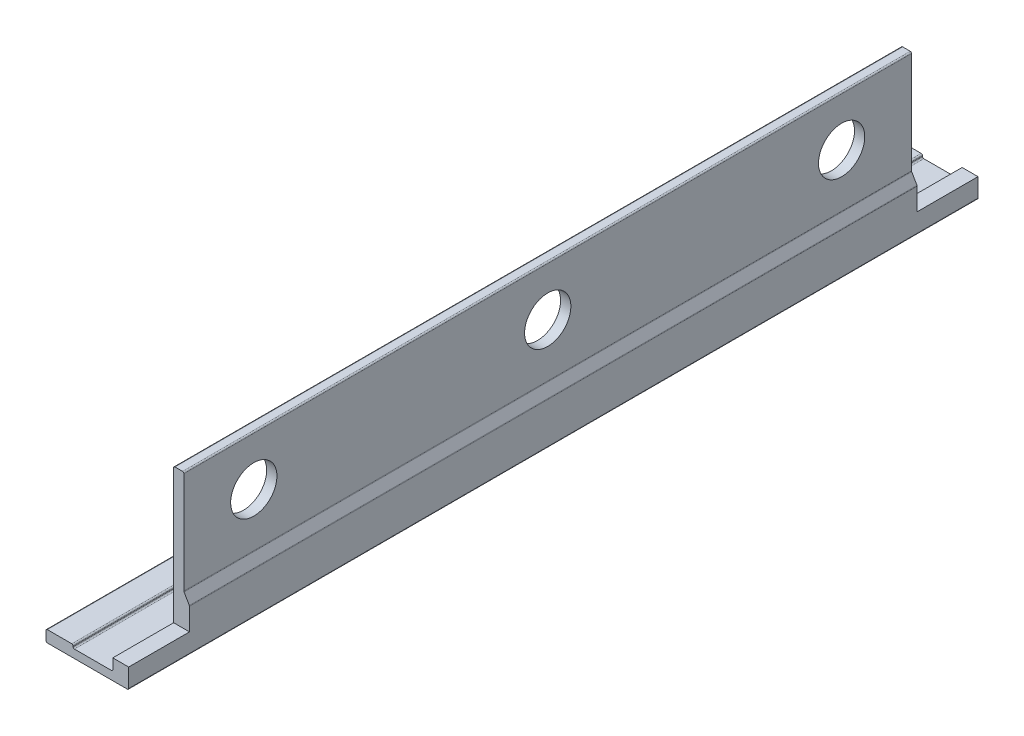
ISO-10303-21;
HEADER;
FILE_DESCRIPTION(('STEP AP214'),'2;1');
FILE_NAME('part.step','',(''),(''),'','','');
FILE_SCHEMA(('AUTOMOTIVE_DESIGN { 1 0 10303 214 1 1 1 1 }'));
ENDSEC;
DATA;
#1=APPLICATION_CONTEXT('core data for automotive mechanical design processes');
#2=APPLICATION_PROTOCOL_DEFINITION('international standard','automotive_design',2000,#1);
#3=PRODUCT_CONTEXT('',#1,'mechanical');
#4=PRODUCT('Part','Part','',(#3));
#5=PRODUCT_RELATED_PRODUCT_CATEGORY('part','',(#4));
#6=PRODUCT_DEFINITION_FORMATION('','',#4);
#7=PRODUCT_DEFINITION_CONTEXT('part definition',#1,'design');
#8=PRODUCT_DEFINITION('design','',#6,#7);
#9=PRODUCT_DEFINITION_SHAPE('','',#8);
#10=(LENGTH_UNIT() NAMED_UNIT(*) SI_UNIT(.MILLI.,.METRE.));
#11=(NAMED_UNIT(*) PLANE_ANGLE_UNIT() SI_UNIT($,.RADIAN.));
#12=(NAMED_UNIT(*) SI_UNIT($,.STERADIAN.) SOLID_ANGLE_UNIT());
#13=UNCERTAINTY_MEASURE_WITH_UNIT(LENGTH_MEASURE(1.E-05),#10,'distance_accuracy_value','');
#14=(GEOMETRIC_REPRESENTATION_CONTEXT(3) GLOBAL_UNCERTAINTY_ASSIGNED_CONTEXT((#13)) GLOBAL_UNIT_ASSIGNED_CONTEXT((#10,
#11,#12)) REPRESENTATION_CONTEXT('',''));
#15=CARTESIAN_POINT('',(0.,0.,0.));
#16=DIRECTION('',(0.,0.,1.));
#17=DIRECTION('',(1.,0.,0.));
#18=AXIS2_PLACEMENT_3D('',#15,#16,#17);
#19=CARTESIAN_POINT('',(-15.756534438729,-70.232902518071,0.));
#20=DIRECTION('',(-1.,0.,0.));
#21=DIRECTION('',(0.,1.,0.));
#22=AXIS2_PLACEMENT_3D('',#19,#20,#21);
#23=PLANE('',#22);
#24=DIRECTION('',(0.,-1.,0.));
#25=VECTOR('',#24,1.);
#26=CARTESIAN_POINT('',(-15.756534438729,-69.557902518071,-128.45));
#27=LINE('',#26,#25);
#28=CARTESIAN_POINT('',(-15.756534438729,-68.8829025180708,-128.45));
#29=VERTEX_POINT('',#28);
#30=CARTESIAN_POINT('',(-15.756534438729,-70.2329025180708,-128.45));
#31=VERTEX_POINT('',#30);
#32=EDGE_CURVE('E265',#29,#31,#27,.T.);
#33=ORIENTED_EDGE('',*,*,#32,.T.);
#34=DIRECTION('',(0.,0.,-1.));
#35=VECTOR('',#34,1.);
#36=CARTESIAN_POINT('',(-15.756534438729,-70.232902518071,-64.225));
#37=LINE('',#36,#35);
#38=CARTESIAN_POINT('',(-15.756534438729,-70.2329025180708,0.));
#39=VERTEX_POINT('',#38);
#40=EDGE_CURVE('E266',#39,#31,#37,.T.);
#41=ORIENTED_EDGE('',*,*,#40,.F.);
#42=DIRECTION('',(0.,1.,0.));
#43=VECTOR('',#42,1.);
#44=CARTESIAN_POINT('',(-15.756534438729,-69.557902518071,0.));
#45=LINE('',#44,#43);
#46=CARTESIAN_POINT('',(-15.756534438729,-68.8829025180708,0.));
#47=VERTEX_POINT('',#46);
#48=EDGE_CURVE('E271',#39,#47,#45,.T.);
#49=ORIENTED_EDGE('',*,*,#48,.T.);
#50=DIRECTION('',(0.,0.,1.));
#51=VECTOR('',#50,1.);
#52=CARTESIAN_POINT('',(-15.756534438729,-68.882902518071,-64.225));
#53=LINE('',#52,#51);
#54=EDGE_CURVE('E274',#29,#47,#53,.T.);
#55=ORIENTED_EDGE('',*,*,#54,.F.);
#56=EDGE_LOOP('',(#33,#41,#49,#55));
#57=FACE_BOUND('',#56,.T.);
#58=ADVANCED_FACE('F17',(#57),#23,.T.);
#59=CARTESIAN_POINT('',(-11.656534438729,-68.882902518071,0.));
#60=DIRECTION('',(1.,0.,0.));
#61=DIRECTION('',(0.,-1.,0.));
#62=AXIS2_PLACEMENT_3D('',#59,#60,#61);
#63=PLANE('',#62);
#64=DIRECTION('',(0.,1.,0.));
#65=VECTOR('',#64,1.);
#66=CARTESIAN_POINT('',(-11.656534438729,-68.932902518071,-128.45));
#67=LINE('',#66,#65);
#68=CARTESIAN_POINT('',(-11.656534438729,-68.9829025180708,-128.45));
#69=VERTEX_POINT('',#68);
#70=CARTESIAN_POINT('',(-11.656534438729,-68.8829025180708,-128.45));
#71=VERTEX_POINT('',#70);
#72=EDGE_CURVE('E170',#69,#71,#67,.T.);
#73=ORIENTED_EDGE('',*,*,#72,.T.);
#74=DIRECTION('',(0.,0.,-1.));
#75=VECTOR('',#74,1.);
#76=CARTESIAN_POINT('',(-11.656534438729,-68.882902518071,-64.225));
#77=LINE('',#76,#75);
#78=CARTESIAN_POINT('',(-11.656534438729,-68.8829025180708,0.));
#79=VERTEX_POINT('',#78);
#80=EDGE_CURVE('E169',#79,#71,#77,.T.);
#81=ORIENTED_EDGE('',*,*,#80,.F.);
#82=DIRECTION('',(0.,-1.,0.));
#83=VECTOR('',#82,1.);
#84=CARTESIAN_POINT('',(-11.656534438729,-68.932902518071,0.));
#85=LINE('',#84,#83);
#86=CARTESIAN_POINT('',(-11.656534438729,-68.9829025180708,0.));
#87=VERTEX_POINT('',#86);
#88=EDGE_CURVE('E165',#79,#87,#85,.T.);
#89=ORIENTED_EDGE('',*,*,#88,.T.);
#90=DIRECTION('',(0.,0.,1.));
#91=VECTOR('',#90,1.);
#92=CARTESIAN_POINT('',(-11.656534438729,-68.982902518071,-64.225));
#93=LINE('',#92,#91);
#94=EDGE_CURVE('E180',#69,#87,#93,.T.);
#95=ORIENTED_EDGE('',*,*,#94,.F.);
#96=EDGE_LOOP('',(#73,#81,#89,#95));
#97=FACE_BOUND('',#96,.T.);
#98=ADVANCED_FACE('F680',(#97),#63,.T.);
#99=CARTESIAN_POINT('',(-11.8565344387285,-68.8829025180706,0.));
#100=DIRECTION('',(0.,0.,-1.));
#101=DIRECTION('',(-1.,0.,0.));
#102=AXIS2_PLACEMENT_3D('',#99,#100,#101);
#103=CYLINDRICAL_SURFACE('',#102,0.199999999999594);
#104=CARTESIAN_POINT('',(-11.8565344387285,-68.8829025180706,-128.45));
#105=DIRECTION('',(0.,0.,-1.));
#106=DIRECTION('',(-1.,0.,0.));
#107=AXIS2_PLACEMENT_3D('',#104,#105,#106);
#108=CIRCLE('',#107,0.199999999999594);
#109=CARTESIAN_POINT('',(-11.8565344387288,-68.682902518071,-128.45));
#110=VERTEX_POINT('',#109);
#111=EDGE_CURVE('E175',#71,#110,#108,.F.);
#112=ORIENTED_EDGE('',*,*,#111,.T.);
#113=DIRECTION('',(0.,0.,-1.));
#114=VECTOR('',#113,1.);
#115=CARTESIAN_POINT('',(-11.856534438729,-68.682902518071,-64.225));
#116=LINE('',#115,#114);
#117=CARTESIAN_POINT('',(-11.8565344387288,-68.682902518071,0.));
#118=VERTEX_POINT('',#117);
#119=EDGE_CURVE('E172',#118,#110,#116,.T.);
#120=ORIENTED_EDGE('',*,*,#119,.F.);
#121=CARTESIAN_POINT('',(-11.8565344387285,-68.8829025180706,0.));
#122=DIRECTION('',(0.,0.,-1.));
#123=DIRECTION('',(-1.,0.,0.));
#124=AXIS2_PLACEMENT_3D('',#121,#122,#123);
#125=CIRCLE('',#124,0.199999999999594);
#126=EDGE_CURVE('E21',#118,#79,#125,.T.);
#127=ORIENTED_EDGE('',*,*,#126,.T.);
#128=ORIENTED_EDGE('',*,*,#80,.T.);
#129=EDGE_LOOP('',(#112,#120,#127,#128));
#130=FACE_BOUND('',#129,.T.);
#131=ADVANCED_FACE('F173',(#130),#103,.T.);
#132=CARTESIAN_POINT('',(-15.5565344387284,-68.8829025180707,0.));
#133=DIRECTION('',(0.,0.,-1.));
#134=DIRECTION('',(-1.,0.,0.));
#135=AXIS2_PLACEMENT_3D('',#132,#133,#134);
#136=CYLINDRICAL_SURFACE('',#135,0.20000000000013);
#137=CARTESIAN_POINT('',(-15.5565344387284,-68.8829025180707,-128.45));
#138=DIRECTION('',(0.,0.,-1.));
#139=DIRECTION('',(-1.,0.,0.));
#140=AXIS2_PLACEMENT_3D('',#137,#138,#139);
#141=CIRCLE('',#140,0.20000000000013);
#142=CARTESIAN_POINT('',(-15.5565344387287,-68.682902518071,-128.45));
#143=VERTEX_POINT('',#142);
#144=EDGE_CURVE('E277',#143,#29,#141,.F.);
#145=ORIENTED_EDGE('',*,*,#144,.T.);
#146=ORIENTED_EDGE('',*,*,#54,.T.);
#147=CARTESIAN_POINT('',(-15.5565344387284,-68.8829025180707,0.));
#148=DIRECTION('',(0.,0.,-1.));
#149=DIRECTION('',(-1.,0.,0.));
#150=AXIS2_PLACEMENT_3D('',#147,#148,#149);
#151=CIRCLE('',#150,0.20000000000013);
#152=CARTESIAN_POINT('',(-15.5565344387287,-68.682902518071,0.));
#153=VERTEX_POINT('',#152);
#154=EDGE_CURVE('E330',#47,#153,#151,.T.);
#155=ORIENTED_EDGE('',*,*,#154,.T.);
#156=DIRECTION('',(0.,0.,1.));
#157=VECTOR('',#156,1.);
#158=CARTESIAN_POINT('',(-15.556534438729,-68.682902518071,-64.225));
#159=LINE('',#158,#157);
#160=EDGE_CURVE('E179',#143,#153,#159,.T.);
#161=ORIENTED_EDGE('',*,*,#160,.F.);
#162=EDGE_LOOP('',(#145,#146,#155,#161));
#163=FACE_BOUND('',#162,.T.);
#164=ADVANCED_FACE('F332',(#163),#136,.T.);
#165=CARTESIAN_POINT('',(-15.5565344387292,-70.2329025180706,0.));
#166=DIRECTION('',(0.,0.,-1.));
#167=DIRECTION('',(-1.,0.,0.));
#168=AXIS2_PLACEMENT_3D('',#165,#166,#167);
#169=CYLINDRICAL_SURFACE('',#168,0.200000000000102);
#170=CARTESIAN_POINT('',(-15.5565344387292,-70.2329025180706,-128.45));
#171=DIRECTION('',(0.,0.,-1.));
#172=DIRECTION('',(-1.,0.,0.));
#173=AXIS2_PLACEMENT_3D('',#170,#171,#172);
#174=CIRCLE('',#173,0.200000000000102);
#175=CARTESIAN_POINT('',(-15.5565344387291,-70.432902518071,-128.45));
#176=VERTEX_POINT('',#175);
#177=EDGE_CURVE('E259',#31,#176,#174,.F.);
#178=ORIENTED_EDGE('',*,*,#177,.T.);
#179=DIRECTION('',(0.,0.,-1.));
#180=VECTOR('',#179,1.);
#181=CARTESIAN_POINT('',(-15.556534438729,-70.432902518071,-64.225));
#182=LINE('',#181,#180);
#183=CARTESIAN_POINT('',(-15.5565344387291,-70.432902518071,0.));
#184=VERTEX_POINT('',#183);
#185=EDGE_CURVE('E238',#184,#176,#182,.T.);
#186=ORIENTED_EDGE('',*,*,#185,.F.);
#187=CARTESIAN_POINT('',(-15.5565344387292,-70.2329025180706,0.));
#188=DIRECTION('',(0.,0.,-1.));
#189=DIRECTION('',(-1.,0.,0.));
#190=AXIS2_PLACEMENT_3D('',#187,#188,#189);
#191=CIRCLE('',#190,0.200000000000102);
#192=EDGE_CURVE('E269',#184,#39,#191,.T.);
#193=ORIENTED_EDGE('',*,*,#192,.T.);
#194=ORIENTED_EDGE('',*,*,#40,.T.);
#195=EDGE_LOOP('',(#178,#186,#193,#194));
#196=FACE_BOUND('',#195,.T.);
#197=ADVANCED_FACE('F339',(#196),#169,.T.);
#198=CARTESIAN_POINT('',(-4.0797395194856,-62.607069493158,0.));
#199=DIRECTION('',(0.866025403784433,0.500000000000009,0.));
#200=DIRECTION('',(0.500000000000009,-0.866025403784433,0.));
#201=AXIS2_PLACEMENT_3D('',#198,#199,#200);
#202=PLANE('',#201);
#203=DIRECTION('',(0.500000000000009,-0.866025403784434,0.));
#204=VECTOR('',#203,1.);
#205=CARTESIAN_POINT('',(-3.6815344387287,-63.296780924861,-9.2));
#206=LINE('',#205,#204);
#207=CARTESIAN_POINT('',(-4.07973951948535,-62.6070694931584,-9.2));
#208=VERTEX_POINT('',#207);
#209=CARTESIAN_POINT('',(-3.28332935797158,-63.9864923565644,-9.2));
#210=VERTEX_POINT('',#209);
#211=EDGE_CURVE('E254',#208,#210,#206,.T.);
#212=ORIENTED_EDGE('',*,*,#211,.T.);
#213=DIRECTION('',(0.,0.,1.));
#214=VECTOR('',#213,1.);
#215=CARTESIAN_POINT('',(-3.2833293579718,-63.986492356564,-64.225));
#216=LINE('',#215,#214);
#217=CARTESIAN_POINT('',(-3.28332935797158,-63.9864923565644,-119.25));
#218=VERTEX_POINT('',#217);
#219=EDGE_CURVE('E260',#218,#210,#216,.T.);
#220=ORIENTED_EDGE('',*,*,#219,.F.);
#221=DIRECTION('',(-0.500000000000009,0.866025403784434,0.));
#222=VECTOR('',#221,1.);
#223=CARTESIAN_POINT('',(-3.6815344387287,-63.296780924861,-119.25));
#224=LINE('',#223,#222);
#225=CARTESIAN_POINT('',(-4.07973951948535,-62.6070694931584,-119.25));
#226=VERTEX_POINT('',#225);
#227=EDGE_CURVE('E256',#218,#226,#224,.T.);
#228=ORIENTED_EDGE('',*,*,#227,.T.);
#229=DIRECTION('',(0.,0.,-1.));
#230=VECTOR('',#229,1.);
#231=CARTESIAN_POINT('',(-4.0797395194856,-62.607069493158,-64.225));
#232=LINE('',#231,#230);
#233=EDGE_CURVE('E250',#208,#226,#232,.T.);
#234=ORIENTED_EDGE('',*,*,#233,.F.);
#235=EDGE_LOOP('',(#212,#220,#228,#234));
#236=FACE_BOUND('',#235,.T.);
#237=ADVANCED_FACE('F479',(#236),#202,.T.);
#238=CARTESIAN_POINT('',(-11.4565344387282,-68.9829025180706,0.));
#239=DIRECTION('',(0.,0.,-1.));
#240=DIRECTION('',(-1.,0.,0.));
#241=AXIS2_PLACEMENT_3D('',#238,#239,#240);
#242=CYLINDRICAL_SURFACE('',#241,0.200000000000563);
#243=CARTESIAN_POINT('',(-11.4565344387282,-68.9829025180706,-128.45));
#244=DIRECTION('',(0.,0.,-1.));
#245=DIRECTION('',(-1.,0.,0.));
#246=AXIS2_PLACEMENT_3D('',#243,#244,#245);
#247=CIRCLE('',#246,0.200000000000563);
#248=CARTESIAN_POINT('',(-11.4565344387286,-69.182902518071,-128.45));
#249=VERTEX_POINT('',#248);
#250=EDGE_CURVE('E226',#69,#249,#247,.F.);
#251=ORIENTED_EDGE('',*,*,#250,.F.);
#252=ORIENTED_EDGE('',*,*,#94,.T.);
#253=CARTESIAN_POINT('',(-11.4565344387282,-68.9829025180706,0.));
#254=DIRECTION('',(0.,0.,-1.));
#255=DIRECTION('',(-1.,0.,0.));
#256=AXIS2_PLACEMENT_3D('',#253,#254,#255);
#257=CIRCLE('',#256,0.200000000000563);
#258=CARTESIAN_POINT('',(-11.4565344387286,-69.182902518071,0.));
#259=VERTEX_POINT('',#258);
#260=EDGE_CURVE('E249',#87,#259,#257,.F.);
#261=ORIENTED_EDGE('',*,*,#260,.T.);
#262=DIRECTION('',(0.,0.,1.));
#263=VECTOR('',#262,1.);
#264=CARTESIAN_POINT('',(-11.456534438729,-69.182902518071,-64.225));
#265=LINE('',#264,#263);
#266=EDGE_CURVE('E197',#249,#259,#265,.T.);
#267=ORIENTED_EDGE('',*,*,#266,.F.);
#268=EDGE_LOOP('',(#251,#252,#261,#267));
#269=FACE_BOUND('',#268,.T.);
#270=ADVANCED_FACE('F648',(#269),#242,.F.);
#271=CARTESIAN_POINT('',(-15.556534438729,-68.682902518071,0.));
#272=DIRECTION('',(0.,1.,0.));
#273=DIRECTION('',(1.,0.,0.));
#274=AXIS2_PLACEMENT_3D('',#271,#272,#273);
#275=PLANE('',#274);
#276=DIRECTION('',(1.,0.,0.));
#277=VECTOR('',#276,1.);
#278=CARTESIAN_POINT('',(-9.50653443872885,-68.682902518071,-128.45));
#279=LINE('',#278,#277);
#280=EDGE_CURVE('E224',#143,#110,#279,.T.);
#281=ORIENTED_EDGE('',*,*,#280,.F.);
#282=ORIENTED_EDGE('',*,*,#160,.T.);
#283=DIRECTION('',(-1.,0.,0.));
#284=VECTOR('',#283,1.);
#285=CARTESIAN_POINT('',(-9.50653443872885,-68.682902518071,0.));
#286=LINE('',#285,#284);
#287=EDGE_CURVE('E163',#118,#153,#286,.T.);
#288=ORIENTED_EDGE('',*,*,#287,.F.);
#289=ORIENTED_EDGE('',*,*,#119,.T.);
#290=EDGE_LOOP('',(#281,#282,#288,#289));
#291=FACE_BOUND('',#290,.T.);
#292=ADVANCED_FACE('F183',(#291),#275,.T.);
#293=CARTESIAN_POINT('',(-3.4565344387287,-70.432902518071,0.));
#294=DIRECTION('',(0.,-1.,0.));
#295=DIRECTION('',(-1.,0.,0.));
#296=AXIS2_PLACEMENT_3D('',#293,#294,#295);
#297=PLANE('',#296);
#298=DIRECTION('',(-1.,0.,0.));
#299=VECTOR('',#298,1.);
#300=CARTESIAN_POINT('',(-9.50653443872885,-70.432902518071,-128.45));
#301=LINE('',#300,#299);
#302=CARTESIAN_POINT('',(-3.45653443872915,-70.432902518071,-128.45));
#303=VERTEX_POINT('',#302);
#304=EDGE_CURVE('E227',#303,#176,#301,.T.);
#305=ORIENTED_EDGE('',*,*,#304,.F.);
#306=DIRECTION('',(0.,0.,-1.));
#307=VECTOR('',#306,1.);
#308=CARTESIAN_POINT('',(-3.4565344387287,-70.432902518071,-64.225));
#309=LINE('',#308,#307);
#310=CARTESIAN_POINT('',(-3.45653443872915,-70.432902518071,0.));
#311=VERTEX_POINT('',#310);
#312=EDGE_CURVE('E234',#311,#303,#309,.T.);
#313=ORIENTED_EDGE('',*,*,#312,.F.);
#314=DIRECTION('',(1.,0.,0.));
#315=VECTOR('',#314,1.);
#316=CARTESIAN_POINT('',(-9.50653443872885,-70.432902518071,0.));
#317=LINE('',#316,#315);
#318=EDGE_CURVE('E185',#184,#311,#317,.T.);
#319=ORIENTED_EDGE('',*,*,#318,.F.);
#320=ORIENTED_EDGE('',*,*,#185,.T.);
#321=EDGE_LOOP('',(#305,#313,#319,#320));
#322=FACE_BOUND('',#321,.T.);
#323=ADVANCED_FACE('F346',(#322),#297,.T.);
#324=CARTESIAN_POINT('',(-3.45653443872742,-64.0864923565643,0.));
#325=DIRECTION('',(0.,0.,-1.));
#326=DIRECTION('',(-1.,0.,0.));
#327=AXIS2_PLACEMENT_3D('',#324,#325,#326);
#328=CYLINDRICAL_SURFACE('',#327,0.19999999999888);
#329=CARTESIAN_POINT('',(-3.45653443872742,-64.0864923565643,-9.2));
#330=DIRECTION('',(0.,0.,-1.));
#331=DIRECTION('',(-1.,0.,0.));
#332=AXIS2_PLACEMENT_3D('',#329,#330,#331);
#333=CIRCLE('',#332,0.19999999999888);
#334=CARTESIAN_POINT('',(-3.256534438729,-64.0864923565641,-9.2));
#335=VERTEX_POINT('',#334);
#336=EDGE_CURVE('E237',#210,#335,#333,.T.);
#337=ORIENTED_EDGE('',*,*,#336,.T.);
#338=DIRECTION('',(0.,0.,1.));
#339=VECTOR('',#338,1.);
#340=CARTESIAN_POINT('',(-3.2565344387287,-64.086492356564,-64.225));
#341=LINE('',#340,#339);
#342=CARTESIAN_POINT('',(-3.2565344387287,-64.0864923565641,-119.25));
#343=VERTEX_POINT('',#342);
#344=EDGE_CURVE('E359',#343,#335,#341,.T.);
#345=ORIENTED_EDGE('',*,*,#344,.F.);
#346=CARTESIAN_POINT('',(-3.45653443872742,-64.0864923565643,-119.25));
#347=DIRECTION('',(0.,0.,-1.));
#348=DIRECTION('',(-1.,0.,0.));
#349=AXIS2_PLACEMENT_3D('',#346,#347,#348);
#350=CIRCLE('',#349,0.19999999999888);
#351=EDGE_CURVE('E240',#343,#218,#350,.F.);
#352=ORIENTED_EDGE('',*,*,#351,.T.);
#353=ORIENTED_EDGE('',*,*,#219,.T.);
#354=EDGE_LOOP('',(#337,#345,#352,#353));
#355=FACE_BOUND('',#354,.T.);
#356=ADVANCED_FACE('F484',(#355),#328,.T.);
#357=CARTESIAN_POINT('',(-3.4565344387296,-70.2329025180709,0.));
#358=DIRECTION('',(0.,0.,-1.));
#359=DIRECTION('',(-1.,0.,0.));
#360=AXIS2_PLACEMENT_3D('',#357,#358,#359);
#361=CYLINDRICAL_SURFACE('',#360,0.200000000000448);
#362=CARTESIAN_POINT('',(-3.4565344387296,-70.2329025180709,-128.45));
#363=DIRECTION('',(0.,0.,-1.));
#364=DIRECTION('',(-1.,0.,0.));
#365=AXIS2_PLACEMENT_3D('',#362,#363,#364);
#366=CIRCLE('',#365,0.200000000000448);
#367=CARTESIAN_POINT('',(-3.2565344387287,-70.232902518071,-128.45));
#368=VERTEX_POINT('',#367);
#369=EDGE_CURVE('E230',#368,#303,#366,.T.);
#370=ORIENTED_EDGE('',*,*,#369,.F.);
#371=DIRECTION('',(0.,0.,-1.));
#372=VECTOR('',#371,1.);
#373=CARTESIAN_POINT('',(-3.2565344387287,-70.232902518071,-64.225));
#374=LINE('',#373,#372);
#375=CARTESIAN_POINT('',(-3.2565344387287,-70.232902518071,0.));
#376=VERTEX_POINT('',#375);
#377=EDGE_CURVE('E214',#376,#368,#374,.T.);
#378=ORIENTED_EDGE('',*,*,#377,.F.);
#379=CARTESIAN_POINT('',(-3.4565344387296,-70.2329025180709,0.));
#380=DIRECTION('',(0.,0.,-1.));
#381=DIRECTION('',(-1.,0.,0.));
#382=AXIS2_PLACEMENT_3D('',#379,#380,#381);
#383=CIRCLE('',#382,0.200000000000448);
#384=EDGE_CURVE('E189',#311,#376,#383,.F.);
#385=ORIENTED_EDGE('',*,*,#384,.F.);
#386=ORIENTED_EDGE('',*,*,#312,.T.);
#387=EDGE_LOOP('',(#370,#378,#385,#386));
#388=FACE_BOUND('',#387,.T.);
#389=ADVANCED_FACE('F348',(#388),#361,.T.);
#390=CARTESIAN_POINT('',(-4.30653443872849,-47.132902518073,0.));
#391=DIRECTION('',(0.,0.,-1.));
#392=DIRECTION('',(-1.,0.,0.));
#393=AXIS2_PLACEMENT_3D('',#390,#391,#392);
#394=CYLINDRICAL_SURFACE('',#393,0.199999999999895);
#395=CARTESIAN_POINT('',(-4.30653443872849,-47.132902518073,-9.2));
#396=DIRECTION('',(0.,0.,-1.));
#397=DIRECTION('',(-1.,0.,0.));
#398=AXIS2_PLACEMENT_3D('',#395,#396,#397);
#399=CIRCLE('',#398,0.199999999999895);
#400=CARTESIAN_POINT('',(-4.30653443872865,-46.932902518073,-9.2));
#401=VERTEX_POINT('',#400);
#402=CARTESIAN_POINT('',(-4.1065344387287,-47.132902518073,-9.2));
#403=VERTEX_POINT('',#402);
#404=EDGE_CURVE('E317',#401,#403,#399,.T.);
#405=ORIENTED_EDGE('',*,*,#404,.T.);
#406=DIRECTION('',(0.,0.,1.));
#407=VECTOR('',#406,1.);
#408=CARTESIAN_POINT('',(-4.1065344387287,-47.132902518073,-64.225));
#409=LINE('',#408,#407);
#410=CARTESIAN_POINT('',(-4.106534438727,-47.132902518073,-119.25));
#411=VERTEX_POINT('',#410);
#412=EDGE_CURVE('E213',#411,#403,#409,.T.);
#413=ORIENTED_EDGE('',*,*,#412,.F.);
#414=CARTESIAN_POINT('',(-4.30653443872849,-47.132902518073,-119.25));
#415=DIRECTION('',(0.,0.,-1.));
#416=DIRECTION('',(-1.,0.,0.));
#417=AXIS2_PLACEMENT_3D('',#414,#415,#416);
#418=CIRCLE('',#417,0.199999999999895);
#419=CARTESIAN_POINT('',(-4.30653443872865,-46.932902518073,-119.25));
#420=VERTEX_POINT('',#419);
#421=EDGE_CURVE('E236',#411,#420,#418,.F.);
#422=ORIENTED_EDGE('',*,*,#421,.T.);
#423=DIRECTION('',(0.,0.,-1.));
#424=VECTOR('',#423,1.);
#425=CARTESIAN_POINT('',(-4.3065344387288,-46.932902518073,-64.225));
#426=LINE('',#425,#424);
#427=EDGE_CURVE('E362',#401,#420,#426,.T.);
#428=ORIENTED_EDGE('',*,*,#427,.F.);
#429=EDGE_LOOP('',(#405,#413,#422,#428));
#430=FACE_BOUND('',#429,.T.);
#431=ADVANCED_FACE('F466',(#430),#394,.T.);
#432=CARTESIAN_POINT('',(-3.90653443872707,-62.5070694931582,0.));
#433=DIRECTION('',(0.,0.,-1.));
#434=DIRECTION('',(-1.,0.,0.));
#435=AXIS2_PLACEMENT_3D('',#432,#433,#434);
#436=CYLINDRICAL_SURFACE('',#435,0.200000000001471);
#437=CARTESIAN_POINT('',(-3.90653443872707,-62.5070694931582,-9.2));
#438=DIRECTION('',(0.,0.,-1.));
#439=DIRECTION('',(-1.,0.,0.));
#440=AXIS2_PLACEMENT_3D('',#437,#438,#439);
#441=CIRCLE('',#440,0.200000000001471);
#442=CARTESIAN_POINT('',(-4.1065344387287,-62.5070694931581,-9.2));
#443=VERTEX_POINT('',#442);
#444=EDGE_CURVE('E253',#443,#208,#441,.F.);
#445=ORIENTED_EDGE('',*,*,#444,.T.);
#446=ORIENTED_EDGE('',*,*,#233,.T.);
#447=CARTESIAN_POINT('',(-3.90653443872707,-62.5070694931582,-119.25));
#448=DIRECTION('',(0.,0.,-1.));
#449=DIRECTION('',(-1.,0.,0.));
#450=AXIS2_PLACEMENT_3D('',#447,#448,#449);
#451=CIRCLE('',#450,0.200000000001471);
#452=CARTESIAN_POINT('',(-4.106534438727,-62.5070694931581,-119.25));
#453=VERTEX_POINT('',#452);
#454=EDGE_CURVE('E315',#226,#453,#451,.T.);
#455=ORIENTED_EDGE('',*,*,#454,.T.);
#456=DIRECTION('',(0.,0.,-1.));
#457=VECTOR('',#456,1.);
#458=CARTESIAN_POINT('',(-4.1065344387287,-62.507069493158,-64.225));
#459=LINE('',#458,#457);
#460=EDGE_CURVE('E376',#443,#453,#459,.T.);
#461=ORIENTED_EDGE('',*,*,#460,.F.);
#462=EDGE_LOOP('',(#445,#446,#455,#461));
#463=FACE_BOUND('',#462,.T.);
#464=ADVANCED_FACE('F480',(#463),#436,.F.);
#465=CARTESIAN_POINT('',(-16.381534438729,-45.757902518073,-128.45));
#466=DIRECTION('',(0.,0.,-1.));
#467=DIRECTION('',(1.,0.,0.));
#468=AXIS2_PLACEMENT_3D('',#465,#466,#467);
#469=PLANE('',#468);
#470=CARTESIAN_POINT('',(-5.85653443872866,-68.9829025180711,-128.45));
#471=DIRECTION('',(0.,0.,-1.));
#472=DIRECTION('',(-1.,0.,0.));
#473=AXIS2_PLACEMENT_3D('',#470,#471,#472);
#474=CIRCLE('',#473,0.199999999999947);
#475=CARTESIAN_POINT('',(-5.85653443872868,-69.182902518071,-128.45));
#476=VERTEX_POINT('',#475);
#477=CARTESIAN_POINT('',(-5.6565344387287,-68.982902518071,-128.45));
#478=VERTEX_POINT('',#477);
#479=EDGE_CURVE('E221',#476,#478,#474,.F.);
#480=ORIENTED_EDGE('',*,*,#479,.T.);
#481=DIRECTION('',(0.,1.,0.));
#482=VECTOR('',#481,1.);
#483=CARTESIAN_POINT('',(-5.6565344387287,-58.682902518072,-128.45));
#484=LINE('',#483,#482);
#485=CARTESIAN_POINT('',(-5.6565344387287,-67.432902518071,-128.45));
#486=VERTEX_POINT('',#485);
#487=EDGE_CURVE('E217',#478,#486,#484,.T.);
#488=ORIENTED_EDGE('',*,*,#487,.T.);
#489=DIRECTION('',(1.,0.,0.));
#490=VECTOR('',#489,1.);
#491=CARTESIAN_POINT('',(-4.3860075997521,-67.432902518071,-128.45));
#492=LINE('',#491,#490);
#493=CARTESIAN_POINT('',(-3.2565344387287,-67.432902518071,-128.45));
#494=VERTEX_POINT('',#493);
#495=EDGE_CURVE('E379',#486,#494,#492,.T.);
#496=ORIENTED_EDGE('',*,*,#495,.T.);
#497=DIRECTION('',(0.,1.,0.));
#498=VECTOR('',#497,1.);
#499=CARTESIAN_POINT('',(-3.2565344387287,-67.1596974373175,-128.45));
#500=LINE('',#499,#498);
#501=EDGE_CURVE('E210',#368,#494,#500,.T.);
#502=ORIENTED_EDGE('',*,*,#501,.F.);
#503=ORIENTED_EDGE('',*,*,#369,.T.);
#504=ORIENTED_EDGE('',*,*,#304,.T.);
#505=ORIENTED_EDGE('',*,*,#177,.F.);
#506=ORIENTED_EDGE('',*,*,#32,.F.);
#507=ORIENTED_EDGE('',*,*,#144,.F.);
#508=ORIENTED_EDGE('',*,*,#280,.T.);
#509=ORIENTED_EDGE('',*,*,#111,.F.);
#510=ORIENTED_EDGE('',*,*,#72,.F.);
#511=ORIENTED_EDGE('',*,*,#250,.T.);
#512=DIRECTION('',(-1.,0.,0.));
#513=VECTOR('',#512,1.);
#514=CARTESIAN_POINT('',(-8.65653443872885,-69.182902518071,-128.45));
#515=LINE('',#514,#513);
#516=EDGE_CURVE('E220',#476,#249,#515,.T.);
#517=ORIENTED_EDGE('',*,*,#516,.F.);
#518=EDGE_LOOP('',(#480,#488,#496,#502,#503,#504,#505,#506,#507,#508,#509,#510,#511,#517));
#519=FACE_BOUND('',#518,.T.);
#520=ADVANCED_FACE('F454',(#519),#469,.T.);
#521=CARTESIAN_POINT('',(-11.456534438729,-69.182902518071,0.));
#522=DIRECTION('',(0.,1.,0.));
#523=DIRECTION('',(1.,0.,0.));
#524=AXIS2_PLACEMENT_3D('',#521,#522,#523);
#525=PLANE('',#524);
#526=ORIENTED_EDGE('',*,*,#516,.T.);
#527=ORIENTED_EDGE('',*,*,#266,.T.);
#528=DIRECTION('',(-1.,0.,0.));
#529=VECTOR('',#528,1.);
#530=CARTESIAN_POINT('',(-9.50653443872885,-69.182902518071,0.));
#531=LINE('',#530,#529);
#532=CARTESIAN_POINT('',(-5.85653443872868,-69.182902518071,0.));
#533=VERTEX_POINT('',#532);
#534=EDGE_CURVE('E186',#533,#259,#531,.T.);
#535=ORIENTED_EDGE('',*,*,#534,.F.);
#536=DIRECTION('',(0.,0.,1.));
#537=VECTOR('',#536,1.);
#538=CARTESIAN_POINT('',(-5.8565344387287,-69.182902518071,-64.225));
#539=LINE('',#538,#537);
#540=EDGE_CURVE('E200',#476,#533,#539,.T.);
#541=ORIENTED_EDGE('',*,*,#540,.F.);
#542=EDGE_LOOP('',(#526,#527,#535,#541));
#543=FACE_BOUND('',#542,.T.);
#544=ADVANCED_FACE('F551',(#543),#525,.T.);
#545=CARTESIAN_POINT('',(-16.381534438729,-71.607902518071,0.));
#546=DIRECTION('',(0.,0.,1.));
#547=DIRECTION('',(1.,0.,0.));
#548=AXIS2_PLACEMENT_3D('',#545,#546,#547);
#549=PLANE('',#548);
#550=ORIENTED_EDGE('',*,*,#384,.T.);
#551=DIRECTION('',(0.,-1.,0.));
#552=VECTOR('',#551,1.);
#553=CARTESIAN_POINT('',(-3.2565344387287,-67.1596974373175,0.));
#554=LINE('',#553,#552);
#555=CARTESIAN_POINT('',(-3.2565344387287,-67.432902518071,0.));
#556=VERTEX_POINT('',#555);
#557=EDGE_CURVE('E233',#556,#376,#554,.T.);
#558=ORIENTED_EDGE('',*,*,#557,.F.);
#559=DIRECTION('',(-1.,0.,0.));
#560=VECTOR('',#559,1.);
#561=CARTESIAN_POINT('',(-4.3860075997521,-67.432902518071,0.));
#562=LINE('',#561,#560);
#563=CARTESIAN_POINT('',(-5.6565344387287,-67.432902518071,0.));
#564=VERTEX_POINT('',#563);
#565=EDGE_CURVE('E203',#556,#564,#562,.T.);
#566=ORIENTED_EDGE('',*,*,#565,.T.);
#567=DIRECTION('',(0.,-1.,0.));
#568=VECTOR('',#567,1.);
#569=CARTESIAN_POINT('',(-5.6565344387287,-58.682902518072,0.));
#570=LINE('',#569,#568);
#571=CARTESIAN_POINT('',(-5.6565344387287,-68.982902518071,0.));
#572=VERTEX_POINT('',#571);
#573=EDGE_CURVE('E192',#564,#572,#570,.T.);
#574=ORIENTED_EDGE('',*,*,#573,.T.);
#575=CARTESIAN_POINT('',(-5.85653443872866,-68.9829025180711,0.));
#576=DIRECTION('',(0.,0.,-1.));
#577=DIRECTION('',(-1.,0.,0.));
#578=AXIS2_PLACEMENT_3D('',#575,#576,#577);
#579=CIRCLE('',#578,0.199999999999947);
#580=EDGE_CURVE('E204',#533,#572,#579,.F.);
#581=ORIENTED_EDGE('',*,*,#580,.F.);
#582=ORIENTED_EDGE('',*,*,#534,.T.);
#583=ORIENTED_EDGE('',*,*,#260,.F.);
#584=ORIENTED_EDGE('',*,*,#88,.F.);
#585=ORIENTED_EDGE('',*,*,#126,.F.);
#586=ORIENTED_EDGE('',*,*,#287,.T.);
#587=ORIENTED_EDGE('',*,*,#154,.F.);
#588=ORIENTED_EDGE('',*,*,#48,.F.);
#589=ORIENTED_EDGE('',*,*,#192,.F.);
#590=ORIENTED_EDGE('',*,*,#318,.T.);
#591=EDGE_LOOP('',(#550,#558,#566,#574,#581,#582,#583,#584,#585,#586,#587,#588,#589,#590));
#592=FACE_BOUND('',#591,.T.);
#593=ADVANCED_FACE('F161',(#592),#549,.T.);
#594=CARTESIAN_POINT('',(-5.4565344387288,-46.932902518073,0.));
#595=DIRECTION('',(0.,1.,0.));
#596=DIRECTION('',(1.,0.,0.));
#597=AXIS2_PLACEMENT_3D('',#594,#595,#596);
#598=PLANE('',#597);
#599=DIRECTION('',(1.,0.,0.));
#600=VECTOR('',#599,1.);
#601=CARTESIAN_POINT('',(-4.3860075997521,-46.932902518073,-9.2));
#602=LINE('',#601,#600);
#603=CARTESIAN_POINT('',(-5.45653443872873,-46.932902518073,-9.2));
#604=VERTEX_POINT('',#603);
#605=EDGE_CURVE('E402',#604,#401,#602,.T.);
#606=ORIENTED_EDGE('',*,*,#605,.T.);
#607=ORIENTED_EDGE('',*,*,#427,.T.);
#608=DIRECTION('',(-1.,0.,0.));
#609=VECTOR('',#608,1.);
#610=CARTESIAN_POINT('',(-4.8815344387288,-46.932902518073,-119.25));
#611=LINE('',#610,#609);
#612=CARTESIAN_POINT('',(-5.45653443872873,-46.932902518073,-119.25));
#613=VERTEX_POINT('',#612);
#614=EDGE_CURVE('E307',#420,#613,#611,.T.);
#615=ORIENTED_EDGE('',*,*,#614,.T.);
#616=DIRECTION('',(0.,0.,-1.));
#617=VECTOR('',#616,1.);
#618=CARTESIAN_POINT('',(-5.4565344387288,-46.932902518073,-64.225));
#619=LINE('',#618,#617);
#620=EDGE_CURVE('E301',#604,#613,#619,.T.);
#621=ORIENTED_EDGE('',*,*,#620,.F.);
#622=EDGE_LOOP('',(#606,#607,#615,#621));
#623=FACE_BOUND('',#622,.T.);
#624=ADVANCED_FACE('F467',(#623),#598,.T.);
#625=CARTESIAN_POINT('',(-3.2565344387287,-64.086492356564,0.));
#626=DIRECTION('',(1.,0.,0.));
#627=DIRECTION('',(0.,-1.,0.));
#628=AXIS2_PLACEMENT_3D('',#625,#626,#627);
#629=PLANE('',#628);
#630=ORIENTED_EDGE('',*,*,#377,.T.);
#631=ORIENTED_EDGE('',*,*,#501,.T.);
#632=DIRECTION('',(0.,0.,1.));
#633=VECTOR('',#632,1.);
#634=CARTESIAN_POINT('',(-3.2565344387287,-67.432902518071,-129.25));
#635=LINE('',#634,#633);
#636=CARTESIAN_POINT('',(-3.2565344387287,-67.432902518071,-119.25));
#637=VERTEX_POINT('',#636);
#638=EDGE_CURVE('E305',#494,#637,#635,.T.);
#639=ORIENTED_EDGE('',*,*,#638,.T.);
#640=DIRECTION('',(0.,1.,0.));
#641=VECTOR('',#640,1.);
#642=CARTESIAN_POINT('',(-3.2565344387287,-53.432902518071,-119.25));
#643=LINE('',#642,#641);
#644=EDGE_CURVE('E294',#637,#343,#643,.T.);
#645=ORIENTED_EDGE('',*,*,#644,.T.);
#646=ORIENTED_EDGE('',*,*,#344,.T.);
#647=DIRECTION('',(0.,-1.,0.));
#648=VECTOR('',#647,1.);
#649=CARTESIAN_POINT('',(-3.2565344387293,-53.432902518071,-9.2));
#650=LINE('',#649,#648);
#651=CARTESIAN_POINT('',(-3.2565344387291,-67.432902518071,-9.2));
#652=VERTEX_POINT('',#651);
#653=EDGE_CURVE('E369',#335,#652,#650,.T.);
#654=ORIENTED_EDGE('',*,*,#653,.T.);
#655=DIRECTION('',(0.,0.,1.));
#656=VECTOR('',#655,1.);
#657=CARTESIAN_POINT('',(-3.2565344387287,-67.432902518071,0.8));
#658=LINE('',#657,#656);
#659=EDGE_CURVE('E356',#652,#556,#658,.T.);
#660=ORIENTED_EDGE('',*,*,#659,.T.);
#661=ORIENTED_EDGE('',*,*,#557,.T.);
#662=EDGE_LOOP('',(#630,#631,#639,#645,#646,#654,#660,#661));
#663=FACE_BOUND('',#662,.T.);
#664=ADVANCED_FACE('F353',(#663),#629,.T.);
#665=CARTESIAN_POINT('',(-4.1065344387287,-47.132902518073,0.));
#666=DIRECTION('',(1.,0.,0.));
#667=DIRECTION('',(0.,-1.,0.));
#668=AXIS2_PLACEMENT_3D('',#665,#666,#667);
#669=PLANE('',#668);
#670=CARTESIAN_POINT('',(-4.10653443872867,-54.482902518071,-108.675));
#671=DIRECTION('',(1.,0.,0.));
#672=DIRECTION('',(0.,1.,0.));
#673=AXIS2_PLACEMENT_3D('',#670,#671,#672);
#674=CIRCLE('',#673,3.49999999999978);
#675=CARTESIAN_POINT('',(-4.10653443872873,-50.9829025180712,-108.675));
#676=VERTEX_POINT('',#675);
#677=EDGE_CURVE('E291',#676,#676,#674,.F.);
#678=ORIENTED_EDGE('',*,*,#677,.T.);
#679=EDGE_LOOP('',(#678));
#680=FACE_BOUND('',#679,.T.);
#681=CARTESIAN_POINT('',(-4.10653443872867,-54.482902518071,-64.225));
#682=DIRECTION('',(1.,0.,0.));
#683=DIRECTION('',(0.,1.,0.));
#684=AXIS2_PLACEMENT_3D('',#681,#682,#683);
#685=CIRCLE('',#684,3.4999999999998);
#686=CARTESIAN_POINT('',(-4.10653443872873,-50.9829025180712,-64.225));
#687=VERTEX_POINT('',#686);
#688=EDGE_CURVE('E288',#687,#687,#685,.F.);
#689=ORIENTED_EDGE('',*,*,#688,.T.);
#690=EDGE_LOOP('',(#689));
#691=FACE_BOUND('',#690,.T.);
#692=CARTESIAN_POINT('',(-4.10653443872867,-54.482902518071,-19.775));
#693=DIRECTION('',(1.,0.,0.));
#694=DIRECTION('',(0.,1.,0.));
#695=AXIS2_PLACEMENT_3D('',#692,#693,#694);
#696=CIRCLE('',#695,3.4999999999998);
#697=CARTESIAN_POINT('',(-4.10653443872873,-50.9829025180712,-19.775));
#698=VERTEX_POINT('',#697);
#699=EDGE_CURVE('E285',#698,#698,#696,.F.);
#700=ORIENTED_EDGE('',*,*,#699,.T.);
#701=EDGE_LOOP('',(#700));
#702=FACE_BOUND('',#701,.T.);
#703=DIRECTION('',(0.,-1.,0.));
#704=VECTOR('',#703,1.);
#705=CARTESIAN_POINT('',(-4.1065344387287,-53.432902518071,-9.2));
#706=LINE('',#705,#704);
#707=EDGE_CURVE('E302',#403,#443,#706,.T.);
#708=ORIENTED_EDGE('',*,*,#707,.T.);
#709=ORIENTED_EDGE('',*,*,#460,.T.);
#710=DIRECTION('',(0.,1.,0.));
#711=VECTOR('',#710,1.);
#712=CARTESIAN_POINT('',(-4.1065344387253,-53.432902518071,-119.25));
#713=LINE('',#712,#711);
#714=EDGE_CURVE('E297',#453,#411,#713,.T.);
#715=ORIENTED_EDGE('',*,*,#714,.T.);
#716=ORIENTED_EDGE('',*,*,#412,.T.);
#717=EDGE_LOOP('',(#708,#709,#715,#716));
#718=FACE_BOUND('',#717,.T.);
#719=ADVANCED_FACE('F473',(#680,#691,#702,#718),#669,.T.);
#720=CARTESIAN_POINT('',(-5.6565344387287,-67.432902518071,-119.25));
#721=DIRECTION('',(0.,-1.,0.));
#722=DIRECTION('',(0.,0.,-1.));
#723=AXIS2_PLACEMENT_3D('',#720,#721,#722);
#724=PLANE('',#723);
#725=DIRECTION('',(1.,0.,0.));
#726=VECTOR('',#725,1.);
#727=CARTESIAN_POINT('',(-4.3860075997521,-67.432902518071,-119.25));
#728=LINE('',#727,#726);
#729=CARTESIAN_POINT('',(-5.6565344387287,-67.432902518071,-119.25));
#730=VERTEX_POINT('',#729);
#731=EDGE_CURVE('E296',#730,#637,#728,.T.);
#732=ORIENTED_EDGE('',*,*,#731,.T.);
#733=ORIENTED_EDGE('',*,*,#638,.F.);
#734=ORIENTED_EDGE('',*,*,#495,.F.);
#735=DIRECTION('',(0.,0.,-1.));
#736=VECTOR('',#735,1.);
#737=CARTESIAN_POINT('',(-5.6565344387287,-67.432902518071,-64.225));
#738=LINE('',#737,#736);
#739=EDGE_CURVE('E209',#730,#486,#738,.T.);
#740=ORIENTED_EDGE('',*,*,#739,.F.);
#741=EDGE_LOOP('',(#732,#733,#734,#740));
#742=FACE_BOUND('',#741,.T.);
#743=ADVANCED_FACE('F459',(#742),#724,.F.);
#744=CARTESIAN_POINT('',(-5.85653443872866,-68.9829025180711,0.));
#745=DIRECTION('',(0.,0.,-1.));
#746=DIRECTION('',(-1.,0.,0.));
#747=AXIS2_PLACEMENT_3D('',#744,#745,#746);
#748=CYLINDRICAL_SURFACE('',#747,0.199999999999947);
#749=ORIENTED_EDGE('',*,*,#479,.F.);
#750=ORIENTED_EDGE('',*,*,#540,.T.);
#751=ORIENTED_EDGE('',*,*,#580,.T.);
#752=DIRECTION('',(0.,0.,1.));
#753=VECTOR('',#752,1.);
#754=CARTESIAN_POINT('',(-5.6565344387287,-68.982902518071,-64.225));
#755=LINE('',#754,#753);
#756=EDGE_CURVE('E205',#478,#572,#755,.T.);
#757=ORIENTED_EDGE('',*,*,#756,.F.);
#758=EDGE_LOOP('',(#749,#750,#751,#757));
#759=FACE_BOUND('',#758,.T.);
#760=ADVANCED_FACE('F538',(#759),#748,.F.);
#761=CARTESIAN_POINT('',(-5.6565344387287,-67.432902518071,10.8));
#762=DIRECTION('',(0.,-1.,0.));
#763=DIRECTION('',(0.,0.,-1.));
#764=AXIS2_PLACEMENT_3D('',#761,#762,#763);
#765=PLANE('',#764);
#766=DIRECTION('',(-1.,0.,0.));
#767=VECTOR('',#766,1.);
#768=CARTESIAN_POINT('',(-4.3860075997521,-67.432902518071,-9.2));
#769=LINE('',#768,#767);
#770=CARTESIAN_POINT('',(-5.6565344387287,-67.432902518071,-9.2));
#771=VERTEX_POINT('',#770);
#772=EDGE_CURVE('E399',#652,#771,#769,.T.);
#773=ORIENTED_EDGE('',*,*,#772,.T.);
#774=DIRECTION('',(0.,0.,-1.));
#775=VECTOR('',#774,1.);
#776=CARTESIAN_POINT('',(-5.6565344387287,-67.432902518071,-64.225));
#777=LINE('',#776,#775);
#778=EDGE_CURVE('E208',#564,#771,#777,.T.);
#779=ORIENTED_EDGE('',*,*,#778,.F.);
#780=ORIENTED_EDGE('',*,*,#565,.F.);
#781=ORIENTED_EDGE('',*,*,#659,.F.);
#782=EDGE_LOOP('',(#773,#779,#780,#781));
#783=FACE_BOUND('',#782,.T.);
#784=ADVANCED_FACE('F535',(#783),#765,.F.);
#785=CARTESIAN_POINT('',(-5.6565344387287,-67.432902518071,-9.2));
#786=DIRECTION('',(0.,0.,-1.));
#787=DIRECTION('',(0.,1.,0.));
#788=AXIS2_PLACEMENT_3D('',#785,#786,#787);
#789=PLANE('',#788);
#790=ORIENTED_EDGE('',*,*,#444,.F.);
#791=ORIENTED_EDGE('',*,*,#707,.F.);
#792=ORIENTED_EDGE('',*,*,#404,.F.);
#793=ORIENTED_EDGE('',*,*,#605,.F.);
#794=CARTESIAN_POINT('',(-5.45653443872865,-47.1329025180729,-9.2));
#795=DIRECTION('',(0.,0.,-1.));
#796=DIRECTION('',(-1.,0.,0.));
#797=AXIS2_PLACEMENT_3D('',#794,#795,#796);
#798=CIRCLE('',#797,0.199999999999979);
#799=CARTESIAN_POINT('',(-5.6565344387287,-47.132902518073,-9.2));
#800=VERTEX_POINT('',#799);
#801=EDGE_CURVE('E298',#800,#604,#798,.T.);
#802=ORIENTED_EDGE('',*,*,#801,.F.);
#803=DIRECTION('',(0.,1.,0.));
#804=VECTOR('',#803,1.);
#805=CARTESIAN_POINT('',(-5.6565344387287,-58.057902518072,-9.2));
#806=LINE('',#805,#804);
#807=EDGE_CURVE('E396',#771,#800,#806,.T.);
#808=ORIENTED_EDGE('',*,*,#807,.F.);
#809=ORIENTED_EDGE('',*,*,#772,.F.);
#810=ORIENTED_EDGE('',*,*,#653,.F.);
#811=ORIENTED_EDGE('',*,*,#336,.F.);
#812=ORIENTED_EDGE('',*,*,#211,.F.);
#813=EDGE_LOOP('',(#790,#791,#792,#793,#802,#808,#809,#810,#811,#812));
#814=FACE_BOUND('',#813,.T.);
#815=ADVANCED_FACE('F469',(#814),#789,.F.);
#816=CARTESIAN_POINT('',(-5.45653443872865,-47.1329025180729,0.));
#817=DIRECTION('',(0.,0.,-1.));
#818=DIRECTION('',(-1.,0.,0.));
#819=AXIS2_PLACEMENT_3D('',#816,#817,#818);
#820=CYLINDRICAL_SURFACE('',#819,0.199999999999979);
#821=ORIENTED_EDGE('',*,*,#801,.T.);
#822=ORIENTED_EDGE('',*,*,#620,.T.);
#823=CARTESIAN_POINT('',(-5.45653443872865,-47.1329025180729,-119.25));
#824=DIRECTION('',(0.,0.,-1.));
#825=DIRECTION('',(-1.,0.,0.));
#826=AXIS2_PLACEMENT_3D('',#823,#824,#825);
#827=CIRCLE('',#826,0.199999999999979);
#828=CARTESIAN_POINT('',(-5.6565344387287,-47.132902518073,-119.25));
#829=VERTEX_POINT('',#828);
#830=EDGE_CURVE('E36',#613,#829,#827,.F.);
#831=ORIENTED_EDGE('',*,*,#830,.T.);
#832=DIRECTION('',(0.,0.,-1.));
#833=VECTOR('',#832,1.);
#834=CARTESIAN_POINT('',(-5.6565344387287,-47.132902518073,-64.225));
#835=LINE('',#834,#833);
#836=EDGE_CURVE('E414',#800,#829,#835,.T.);
#837=ORIENTED_EDGE('',*,*,#836,.F.);
#838=EDGE_LOOP('',(#821,#822,#831,#837));
#839=FACE_BOUND('',#838,.T.);
#840=ADVANCED_FACE('F530',(#839),#820,.T.);
#841=CARTESIAN_POINT('',(-5.6565344387287,-39.432902518071,-119.25));
#842=DIRECTION('',(0.,0.,1.));
#843=DIRECTION('',(0.,-1.,0.));
#844=AXIS2_PLACEMENT_3D('',#841,#842,#843);
#845=PLANE('',#844);
#846=ORIENTED_EDGE('',*,*,#731,.F.);
#847=DIRECTION('',(0.,-1.,0.));
#848=VECTOR('',#847,1.);
#849=CARTESIAN_POINT('',(-5.6565344387287,-58.057902518072,-119.25));
#850=LINE('',#849,#848);
#851=EDGE_CURVE('E284',#829,#730,#850,.T.);
#852=ORIENTED_EDGE('',*,*,#851,.F.);
#853=ORIENTED_EDGE('',*,*,#830,.F.);
#854=ORIENTED_EDGE('',*,*,#614,.F.);
#855=ORIENTED_EDGE('',*,*,#421,.F.);
#856=ORIENTED_EDGE('',*,*,#714,.F.);
#857=ORIENTED_EDGE('',*,*,#454,.F.);
#858=ORIENTED_EDGE('',*,*,#227,.F.);
#859=ORIENTED_EDGE('',*,*,#351,.F.);
#860=ORIENTED_EDGE('',*,*,#644,.F.);
#861=EDGE_LOOP('',(#846,#852,#853,#854,#855,#856,#857,#858,#859,#860));
#862=FACE_BOUND('',#861,.T.);
#863=ADVANCED_FACE('F441',(#862),#845,.F.);
#864=CARTESIAN_POINT('',(-5.65653443872867,-54.482902518071,-108.675));
#865=DIRECTION('',(1.,0.,0.));
#866=DIRECTION('',(0.,1.,0.));
#867=AXIS2_PLACEMENT_3D('',#864,#865,#866);
#868=CYLINDRICAL_SURFACE('',#867,3.49999999999978);
#869=CARTESIAN_POINT('',(-5.65653443872867,-54.482902518071,-108.675));
#870=DIRECTION('',(1.,0.,0.));
#871=DIRECTION('',(0.,1.,0.));
#872=AXIS2_PLACEMENT_3D('',#869,#870,#871);
#873=CIRCLE('',#872,3.49999999999978);
#874=CARTESIAN_POINT('',(-5.65653443872873,-50.9829025180712,-108.675));
#875=VERTEX_POINT('',#874);
#876=EDGE_CURVE('E281',#875,#875,#873,.T.);
#877=ORIENTED_EDGE('',*,*,#876,.F.);
#878=EDGE_LOOP('',(#877));
#879=FACE_BOUND('',#878,.T.);
#880=ORIENTED_EDGE('',*,*,#677,.F.);
#881=EDGE_LOOP('',(#880));
#882=FACE_BOUND('',#881,.T.);
#883=ADVANCED_FACE('F508',(#879,#882),#868,.F.);
#884=CARTESIAN_POINT('',(-5.65653443872867,-54.482902518071,-64.225));
#885=DIRECTION('',(1.,0.,0.));
#886=DIRECTION('',(0.,1.,0.));
#887=AXIS2_PLACEMENT_3D('',#884,#885,#886);
#888=CYLINDRICAL_SURFACE('',#887,3.4999999999998);
#889=CARTESIAN_POINT('',(-5.65653443872867,-54.482902518071,-64.225));
#890=DIRECTION('',(1.,0.,0.));
#891=DIRECTION('',(0.,1.,0.));
#892=AXIS2_PLACEMENT_3D('',#889,#890,#891);
#893=CIRCLE('',#892,3.4999999999998);
#894=CARTESIAN_POINT('',(-5.65653443872873,-50.9829025180712,-64.225));
#895=VERTEX_POINT('',#894);
#896=EDGE_CURVE('E27',#895,#895,#893,.T.);
#897=ORIENTED_EDGE('',*,*,#896,.F.);
#898=EDGE_LOOP('',(#897));
#899=FACE_BOUND('',#898,.T.);
#900=ORIENTED_EDGE('',*,*,#688,.F.);
#901=EDGE_LOOP('',(#900));
#902=FACE_BOUND('',#901,.T.);
#903=ADVANCED_FACE('F500',(#899,#902),#888,.F.);
#904=CARTESIAN_POINT('',(-5.65653443872867,-54.482902518071,-19.775));
#905=DIRECTION('',(1.,0.,0.));
#906=DIRECTION('',(0.,1.,0.));
#907=AXIS2_PLACEMENT_3D('',#904,#905,#906);
#908=CYLINDRICAL_SURFACE('',#907,3.4999999999998);
#909=CARTESIAN_POINT('',(-5.65653443872867,-54.482902518071,-19.775));
#910=DIRECTION('',(1.,0.,0.));
#911=DIRECTION('',(0.,1.,0.));
#912=AXIS2_PLACEMENT_3D('',#909,#910,#911);
#913=CIRCLE('',#912,3.4999999999998);
#914=CARTESIAN_POINT('',(-5.65653443872873,-50.9829025180712,-19.775));
#915=VERTEX_POINT('',#914);
#916=EDGE_CURVE('E11',#915,#915,#913,.T.);
#917=ORIENTED_EDGE('',*,*,#916,.F.);
#918=EDGE_LOOP('',(#917));
#919=FACE_BOUND('',#918,.T.);
#920=ORIENTED_EDGE('',*,*,#699,.F.);
#921=EDGE_LOOP('',(#920));
#922=FACE_BOUND('',#921,.T.);
#923=ADVANCED_FACE('F495',(#919,#922),#908,.F.);
#924=CARTESIAN_POINT('',(-5.6565344387287,-68.982902518071,0.));
#925=DIRECTION('',(-1.,0.,0.));
#926=DIRECTION('',(0.,1.,0.));
#927=AXIS2_PLACEMENT_3D('',#924,#925,#926);
#928=PLANE('',#927);
#929=ORIENTED_EDGE('',*,*,#916,.T.);
#930=EDGE_LOOP('',(#929));
#931=FACE_BOUND('',#930,.T.);
#932=ORIENTED_EDGE('',*,*,#896,.T.);
#933=EDGE_LOOP('',(#932));
#934=FACE_BOUND('',#933,.T.);
#935=ORIENTED_EDGE('',*,*,#876,.T.);
#936=EDGE_LOOP('',(#935));
#937=FACE_BOUND('',#936,.T.);
#938=ORIENTED_EDGE('',*,*,#836,.T.);
#939=ORIENTED_EDGE('',*,*,#851,.T.);
#940=ORIENTED_EDGE('',*,*,#739,.T.);
#941=ORIENTED_EDGE('',*,*,#487,.F.);
#942=ORIENTED_EDGE('',*,*,#756,.T.);
#943=ORIENTED_EDGE('',*,*,#573,.F.);
#944=ORIENTED_EDGE('',*,*,#778,.T.);
#945=ORIENTED_EDGE('',*,*,#807,.T.);
#946=EDGE_LOOP('',(#938,#939,#940,#941,#942,#943,#944,#945));
#947=FACE_BOUND('',#946,.T.);
#948=ADVANCED_FACE('F19',(#931,#934,#937,#947),#928,.T.);
#949=CLOSED_SHELL('',(#58,#98,#131,#164,#197,#237,#270,#292,#323,#356,#389,#431,#464,#520,#544,
#593,#624,#664,#719,#743,#760,#784,#815,#840,#863,#883,#903,#923,#948));
#950=MANIFOLD_SOLID_BREP('B1',#949);
#951=ADVANCED_BREP_SHAPE_REPRESENTATION('',(#18,#950),#14);
#952=SHAPE_DEFINITION_REPRESENTATION(#9,#951);
ENDSEC;
END-ISO-10303-21;
